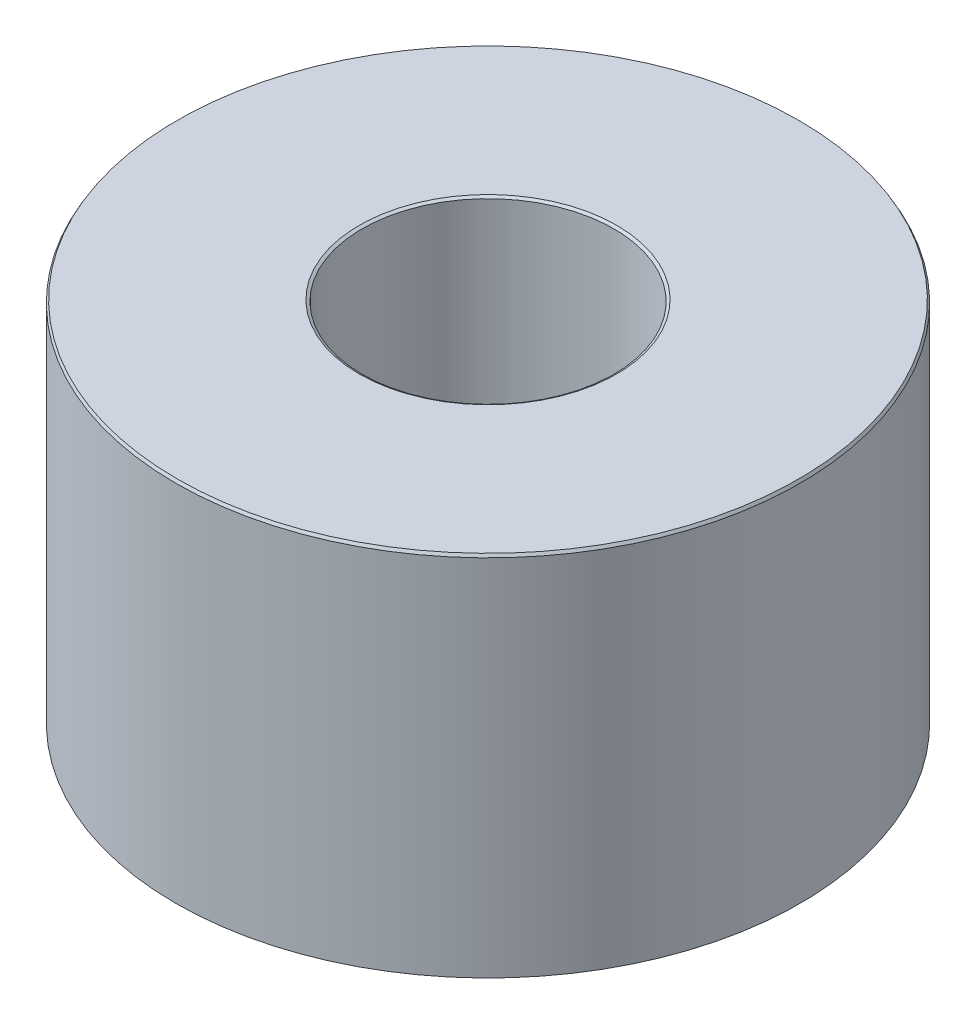
ISO-10303-21;
HEADER;
FILE_DESCRIPTION(('STEP AP214'),'2;1');
FILE_NAME('part.step','',(''),(''),'','','');
FILE_SCHEMA(('AUTOMOTIVE_DESIGN { 1 0 10303 214 1 1 1 1 }'));
ENDSEC;
DATA;
#1=APPLICATION_CONTEXT('core data for automotive mechanical design processes');
#2=APPLICATION_PROTOCOL_DEFINITION('international standard','automotive_design',2000,#1);
#3=PRODUCT_CONTEXT('',#1,'mechanical');
#4=PRODUCT('Part','Part','',(#3));
#5=PRODUCT_RELATED_PRODUCT_CATEGORY('part','',(#4));
#6=PRODUCT_DEFINITION_FORMATION('','',#4);
#7=PRODUCT_DEFINITION_CONTEXT('part definition',#1,'design');
#8=PRODUCT_DEFINITION('design','',#6,#7);
#9=PRODUCT_DEFINITION_SHAPE('','',#8);
#10=(LENGTH_UNIT() NAMED_UNIT(*) SI_UNIT(.MILLI.,.METRE.));
#11=(NAMED_UNIT(*) PLANE_ANGLE_UNIT() SI_UNIT($,.RADIAN.));
#12=(NAMED_UNIT(*) SI_UNIT($,.STERADIAN.) SOLID_ANGLE_UNIT());
#13=UNCERTAINTY_MEASURE_WITH_UNIT(LENGTH_MEASURE(1.E-05),#10,'distance_accuracy_value','');
#14=(GEOMETRIC_REPRESENTATION_CONTEXT(3) GLOBAL_UNCERTAINTY_ASSIGNED_CONTEXT((#13)) GLOBAL_UNIT_ASSIGNED_CONTEXT((#10,
#11,#12)) REPRESENTATION_CONTEXT('',''));
#15=CARTESIAN_POINT('',(0.,0.,0.));
#16=DIRECTION('',(0.,0.,1.));
#17=DIRECTION('',(1.,0.,0.));
#18=AXIS2_PLACEMENT_3D('',#15,#16,#17);
#19=CARTESIAN_POINT('',(0.,26.5322831605084,0.));
#20=DIRECTION('',(0.,-1.,0.));
#21=DIRECTION('',(0.,0.,-1.));
#22=AXIS2_PLACEMENT_3D('',#19,#20,#21);
#23=CYLINDRICAL_SURFACE('',#22,22.5);
#24=CARTESIAN_POINT('',(0.,0.116064034554862,0.));
#25=DIRECTION('',(0.,1.,0.));
#26=DIRECTION('',(0.,0.,1.));
#27=AXIS2_PLACEMENT_3D('',#24,#25,#26);
#28=CIRCLE('',#27,22.5);
#29=CARTESIAN_POINT('',(0.,0.116064034554862,22.5));
#30=VERTEX_POINT('',#29);
#31=EDGE_CURVE('E10',#30,#30,#28,.T.);
#32=ORIENTED_EDGE('',*,*,#31,.T.);
#33=EDGE_LOOP('',(#32));
#34=FACE_BOUND('',#33,.T.);
#35=CARTESIAN_POINT('',(0.,26.3312543557279,0.));
#36=DIRECTION('',(0.,1.,0.));
#37=DIRECTION('',(0.,0.,1.));
#38=AXIS2_PLACEMENT_3D('',#35,#36,#37);
#39=CIRCLE('',#38,22.5);
#40=CARTESIAN_POINT('',(0.,26.3312543557279,-22.5));
#41=VERTEX_POINT('',#40);
#42=EDGE_CURVE('E50',#41,#41,#39,.F.);
#43=ORIENTED_EDGE('',*,*,#42,.T.);
#44=EDGE_LOOP('',(#43));
#45=FACE_BOUND('',#44,.T.);
#46=ADVANCED_FACE('F39',(#34,#45),#23,.T.);
#47=CARTESIAN_POINT('',(0.,26.5322831605084,0.));
#48=DIRECTION('',(0.,1.,0.));
#49=DIRECTION('',(0.,0.,1.));
#50=AXIS2_PLACEMENT_3D('',#47,#48,#49);
#51=PLANE('',#50);
#52=CARTESIAN_POINT('',(0.,26.5322831605084,0.));
#53=DIRECTION('',(0.,1.,0.));
#54=DIRECTION('',(0.,0.,1.));
#55=AXIS2_PLACEMENT_3D('',#52,#53,#54);
#56=CIRCLE('',#55,9.27680456705215);
#57=CARTESIAN_POINT('',(0.,26.5322831605084,9.27680456705215));
#58=VERTEX_POINT('',#57);
#59=EDGE_CURVE('E58',#58,#58,#56,.F.);
#60=ORIENTED_EDGE('',*,*,#59,.T.);
#61=EDGE_LOOP('',(#60));
#62=FACE_BOUND('',#61,.T.);
#63=CARTESIAN_POINT('',(0.,26.5322831605084,0.));
#64=DIRECTION('',(0.,1.,0.));
#65=DIRECTION('',(0.,0.,1.));
#66=AXIS2_PLACEMENT_3D('',#63,#64,#65);
#67=CIRCLE('',#66,22.3839359654451);
#68=CARTESIAN_POINT('',(0.,26.5322831605084,-22.3839359654451));
#69=VERTEX_POINT('',#68);
#70=EDGE_CURVE('E61',#69,#69,#67,.T.);
#71=ORIENTED_EDGE('',*,*,#70,.T.);
#72=EDGE_LOOP('',(#71));
#73=FACE_BOUND('',#72,.T.);
#74=ADVANCED_FACE('F88',(#62,#73),#51,.T.);
#75=CARTESIAN_POINT('',(0.,0.,0.));
#76=DIRECTION('',(0.,1.,0.));
#77=DIRECTION('',(0.,0.,1.));
#78=AXIS2_PLACEMENT_3D('',#75,#76,#77);
#79=PLANE('',#78);
#80=CARTESIAN_POINT('',(0.,0.,0.));
#81=DIRECTION('',(0.,1.,0.));
#82=DIRECTION('',(0.,0.,1.));
#83=AXIS2_PLACEMENT_3D('',#80,#81,#82);
#84=CIRCLE('',#83,9.19183979682657);
#85=CARTESIAN_POINT('',(0.,0.,9.19183979682657));
#86=VERTEX_POINT('',#85);
#87=EDGE_CURVE('E51',#86,#86,#84,.T.);
#88=ORIENTED_EDGE('',*,*,#87,.T.);
#89=EDGE_LOOP('',(#88));
#90=FACE_BOUND('',#89,.T.);
#91=CARTESIAN_POINT('',(0.,0.,0.));
#92=DIRECTION('',(0.,1.,0.));
#93=DIRECTION('',(0.,0.,1.));
#94=AXIS2_PLACEMENT_3D('',#91,#92,#93);
#95=CIRCLE('',#94,22.2989711952196);
#96=CARTESIAN_POINT('',(0.,0.,22.2989711952196));
#97=VERTEX_POINT('',#96);
#98=EDGE_CURVE('E54',#97,#97,#95,.F.);
#99=ORIENTED_EDGE('',*,*,#98,.T.);
#100=EDGE_LOOP('',(#99));
#101=FACE_BOUND('',#100,.T.);
#102=ADVANCED_FACE('F83',(#90,#101),#79,.F.);
#103=CARTESIAN_POINT('',(0.,26.5322831605084,0.));
#104=DIRECTION('',(0.,-1.,0.));
#105=DIRECTION('',(0.,0.,-1.));
#106=AXIS2_PLACEMENT_3D('',#103,#104,#105);
#107=CYLINDRICAL_SURFACE('',#106,9.0757757622717);
#108=CARTESIAN_POINT('',(0.,26.4162191259536,0.));
#109=DIRECTION('',(0.,1.,0.));
#110=DIRECTION('',(0.,0.,1.));
#111=AXIS2_PLACEMENT_3D('',#108,#109,#110);
#112=CIRCLE('',#111,9.0757757622717);
#113=CARTESIAN_POINT('',(0.,26.4162191259536,9.0757757622717));
#114=VERTEX_POINT('',#113);
#115=EDGE_CURVE('E67',#114,#114,#112,.T.);
#116=ORIENTED_EDGE('',*,*,#115,.T.);
#117=EDGE_LOOP('',(#116));
#118=FACE_BOUND('',#117,.T.);
#119=CARTESIAN_POINT('',(0.,0.201028804780467,0.));
#120=DIRECTION('',(0.,1.,0.));
#121=DIRECTION('',(0.,0.,1.));
#122=AXIS2_PLACEMENT_3D('',#119,#120,#121);
#123=CIRCLE('',#122,9.0757757622717);
#124=CARTESIAN_POINT('',(0.,0.201028804780467,9.0757757622717));
#125=VERTEX_POINT('',#124);
#126=EDGE_CURVE('E69',#125,#125,#123,.F.);
#127=ORIENTED_EDGE('',*,*,#126,.T.);
#128=EDGE_LOOP('',(#127));
#129=FACE_BOUND('',#128,.T.);
#130=ADVANCED_FACE('F71',(#118,#129),#107,.F.);
#131=CARTESIAN_POINT('',(0.,26.4162191259536,0.));
#132=DIRECTION('',(0.,1.,0.));
#133=DIRECTION('',(0.,0.,1.));
#134=AXIS2_PLACEMENT_3D('',#131,#132,#133);
#135=CONICAL_SURFACE('',#134,9.0757757622717,1.0471975511966);
#136=ORIENTED_EDGE('',*,*,#59,.F.);
#137=EDGE_LOOP('',(#136));
#138=FACE_BOUND('',#137,.T.);
#139=ORIENTED_EDGE('',*,*,#115,.F.);
#140=EDGE_LOOP('',(#139));
#141=FACE_BOUND('',#140,.T.);
#142=ADVANCED_FACE('F77',(#138,#141),#135,.F.);
#143=CARTESIAN_POINT('',(0.,0.,0.));
#144=DIRECTION('',(0.,-1.,0.));
#145=DIRECTION('',(0.,0.,-1.));
#146=AXIS2_PLACEMENT_3D('',#143,#144,#145);
#147=CONICAL_SURFACE('',#146,9.19183979682657,0.523598775598295);
#148=ORIENTED_EDGE('',*,*,#126,.F.);
#149=EDGE_LOOP('',(#148));
#150=FACE_BOUND('',#149,.T.);
#151=ORIENTED_EDGE('',*,*,#87,.F.);
#152=EDGE_LOOP('',(#151));
#153=FACE_BOUND('',#152,.T.);
#154=ADVANCED_FACE('F73',(#150,#153),#147,.F.);
#155=CARTESIAN_POINT('',(0.,0.116064034554862,0.));
#156=DIRECTION('',(0.,1.,0.));
#157=DIRECTION('',(0.,0.,1.));
#158=AXIS2_PLACEMENT_3D('',#155,#156,#157);
#159=CONICAL_SURFACE('',#158,22.5,1.0471975511966);
#160=ORIENTED_EDGE('',*,*,#98,.F.);
#161=EDGE_LOOP('',(#160));
#162=FACE_BOUND('',#161,.T.);
#163=ORIENTED_EDGE('',*,*,#31,.F.);
#164=EDGE_LOOP('',(#163));
#165=FACE_BOUND('',#164,.T.);
#166=ADVANCED_FACE('F76',(#162,#165),#159,.T.);
#167=CARTESIAN_POINT('',(0.,26.5322831605084,0.));
#168=DIRECTION('',(0.,-1.,0.));
#169=DIRECTION('',(0.,0.,-1.));
#170=AXIS2_PLACEMENT_3D('',#167,#168,#169);
#171=CONICAL_SURFACE('',#170,22.3839359654451,0.523598775598318);
#172=CARTESIAN_POINT('',(0.,26.3312543557279,-22.5));
#173=CARTESIAN_POINT('',(0.,26.3333484057777,-22.4987909996401));
#174=CARTESIAN_POINT('',(0.,26.3354424558275,-22.4975819992801));
#175=CARTESIAN_POINT('',(0.,26.3396305559271,-22.4951639985602));
#176=CARTESIAN_POINT('',(0.,26.3417246059769,-22.4939549982003));
#177=CARTESIAN_POINT('',(0.,26.3459127060765,-22.4915369974804));
#178=CARTESIAN_POINT('',(0.,26.3480067561263,-22.4903279971204));
#179=CARTESIAN_POINT('',(0.,26.3521948562259,-22.4879099964005));
#180=CARTESIAN_POINT('',(0.,26.3542889062757,-22.4867009960406));
#181=CARTESIAN_POINT('',(0.,26.3584770063753,-22.4842829953207));
#182=CARTESIAN_POINT('',(0.,26.3605710564251,-22.4830739949607));
#183=CARTESIAN_POINT('',(0.,26.3647591565247,-22.4806559942409));
#184=CARTESIAN_POINT('',(0.,26.3668532065745,-22.4794469938809));
#185=CARTESIAN_POINT('',(0.,26.3710413066741,-22.477028993161));
#186=CARTESIAN_POINT('',(0.,26.3731353567239,-22.4758199928011));
#187=CARTESIAN_POINT('',(0.,26.3773234568235,-22.4734019920812));
#188=CARTESIAN_POINT('',(0.,26.3794175068733,-22.4721929917212));
#189=CARTESIAN_POINT('',(0.,26.3836056069729,-22.4697749910013));
#190=CARTESIAN_POINT('',(0.,26.3856996570227,-22.4685659906414));
#191=CARTESIAN_POINT('',(0.,26.3898877571223,-22.4661479899215));
#192=CARTESIAN_POINT('',(0.,26.3919818071721,-22.4649389895616));
#193=CARTESIAN_POINT('',(0.,26.3961699072716,-22.4625209888417));
#194=CARTESIAN_POINT('',(0.,26.3982639573214,-22.4613119884817));
#195=CARTESIAN_POINT('',(0.,26.402452057421,-22.4588939877618));
#196=CARTESIAN_POINT('',(0.,26.4045461074708,-22.4576849874019));
#197=CARTESIAN_POINT('',(0.,26.4087342075704,-22.455266986682));
#198=CARTESIAN_POINT('',(0.,26.4108282576202,-22.454057986322));
#199=CARTESIAN_POINT('',(0.,26.4150163577198,-22.4516399856021));
#200=CARTESIAN_POINT('',(0.,26.4171104077696,-22.4504309852422));
#201=CARTESIAN_POINT('',(0.,26.4212985078692,-22.4480129845223));
#202=CARTESIAN_POINT('',(0.,26.423392557919,-22.4468039841624));
#203=CARTESIAN_POINT('',(0.,26.4275806580186,-22.4443859834425));
#204=CARTESIAN_POINT('',(0.,26.4296747080684,-22.4431769830825));
#205=CARTESIAN_POINT('',(0.,26.433862808168,-22.4407589823626));
#206=CARTESIAN_POINT('',(0.,26.4359568582178,-22.4395499820027));
#207=CARTESIAN_POINT('',(0.,26.4401449583174,-22.4371319812828));
#208=CARTESIAN_POINT('',(0.,26.4422390083672,-22.4359229809228));
#209=CARTESIAN_POINT('',(0.,26.4464271084668,-22.4335049802029));
#210=CARTESIAN_POINT('',(0.,26.4485211585166,-22.432295979843));
#211=CARTESIAN_POINT('',(0.,26.4527092586161,-22.4298779791231));
#212=CARTESIAN_POINT('',(0.,26.4548033086659,-22.4286689787631));
#213=CARTESIAN_POINT('',(0.,26.4589914087655,-22.4262509780433));
#214=CARTESIAN_POINT('',(0.,26.4610854588153,-22.4250419776833));
#215=CARTESIAN_POINT('',(0.,26.4652735589149,-22.4226239769634));
#216=CARTESIAN_POINT('',(0.,26.4673676089647,-22.4214149766035));
#217=CARTESIAN_POINT('',(0.,26.4715557090643,-22.4189969758836));
#218=CARTESIAN_POINT('',(0.,26.4736497591141,-22.4177879755236));
#219=CARTESIAN_POINT('',(0.,26.4778378592137,-22.4153699748037));
#220=CARTESIAN_POINT('',(0.,26.4799319092635,-22.4141609744438));
#221=CARTESIAN_POINT('',(0.,26.4841200093631,-22.4117429737239));
#222=CARTESIAN_POINT('',(0.,26.4862140594129,-22.4105339733639));
#223=CARTESIAN_POINT('',(0.,26.4904021595125,-22.4081159726441));
#224=CARTESIAN_POINT('',(0.,26.4924962095623,-22.4069069722841));
#225=CARTESIAN_POINT('',(0.,26.4966843096619,-22.4044889715642));
#226=CARTESIAN_POINT('',(0.,26.4987783597117,-22.4032799712043));
#227=CARTESIAN_POINT('',(0.,26.5029664598113,-22.4008619704844));
#228=CARTESIAN_POINT('',(0.,26.5050605098611,-22.3996529701244));
#229=CARTESIAN_POINT('',(0.,26.5092486099607,-22.3972349694045));
#230=CARTESIAN_POINT('',(0.,26.5113426600105,-22.3960259690446));
#231=CARTESIAN_POINT('',(0.,26.51553076011,-22.3936079683247));
#232=CARTESIAN_POINT('',(0.,26.5176248101598,-22.3923989679647));
#233=CARTESIAN_POINT('',(0.,26.5218129102594,-22.3899809672449));
#234=CARTESIAN_POINT('',(0.,26.5239069603092,-22.3887719668849));
#235=CARTESIAN_POINT('',(0.,26.5280950604088,-22.386353966165));
#236=CARTESIAN_POINT('',(0.,26.5301891104586,-22.3851449658051));
#237=CARTESIAN_POINT('',(0.,26.5322831605084,-22.3839359654451));
#238=B_SPLINE_CURVE_WITH_KNOTS('',3,(#172,#173,#174,#175,#176,#177,#178,#179,#180,#181,#182,
#183,#184,#185,#186,#187,#188,#189,#190,#191,#192,#193,#194,#195,#196,#197,#198,#199,#200,#201,
#202,#203,#204,#205,#206,#207,#208,#209,#210,#211,#212,#213,#214,#215,#216,#217,#218,#219,#220,
#221,#222,#223,#224,#225,#226,#227,#228,#229,#230,#231,#232,#233,#234,#235,#236,#237),
.UNSPECIFIED.,.F.,.F.,(4,2,2,2,2,2,2,2,2,2,2,2,2,2,2,2,2,2,2,2,2,2,2,2,2,2,2,2,2,2,2,2,4),(0.,
0.0072540021596794,0.0145080043193588,0.0217620064790382,0.0290160086387176,0.036270010798397,
0.0435240129580794,0.0507780151177571,0.0580320172774365,0.0652860194371159,0.0725400215967953,
0.0797940237564777,0.0870480259161571,0.0943020280758365,0.101556030235516,0.108810032395195,
0.116064034554878,0.123318036714557,0.130572038874237,0.137826041033916,0.145080043193595,
0.152334045353275,0.159588047512957,0.166842049672637,0.174096051832316,0.181350053991995,
0.188604056151675,0.195858058311357,0.203112060471037,0.210366062630716,0.217620064790395,
0.224874066950075,0.232128069109757),.UNSPECIFIED.);
#239=EDGE_CURVE('BSEAM45',#41,#69,#238,.T.);
#240=ORIENTED_EDGE('',*,*,#42,.F.);
#241=ORIENTED_EDGE('',*,*,#70,.F.);
#242=ORIENTED_EDGE('',*,*,#239,.T.);
#243=ORIENTED_EDGE('',*,*,#239,.F.);
#244=EDGE_LOOP('',(#240,#242,#241,#243));
#245=FACE_BOUND('',#244,.T.);
#246=ADVANCED_FACE('F45',(#245),#171,.T.);
#247=CLOSED_SHELL('',(#46,#74,#102,#130,#142,#154,#166,#246));
#248=MANIFOLD_SOLID_BREP('B2',#247);
#249=ADVANCED_BREP_SHAPE_REPRESENTATION('',(#18,#248),#14);
#250=SHAPE_DEFINITION_REPRESENTATION(#9,#249);
ENDSEC;
END-ISO-10303-21;
